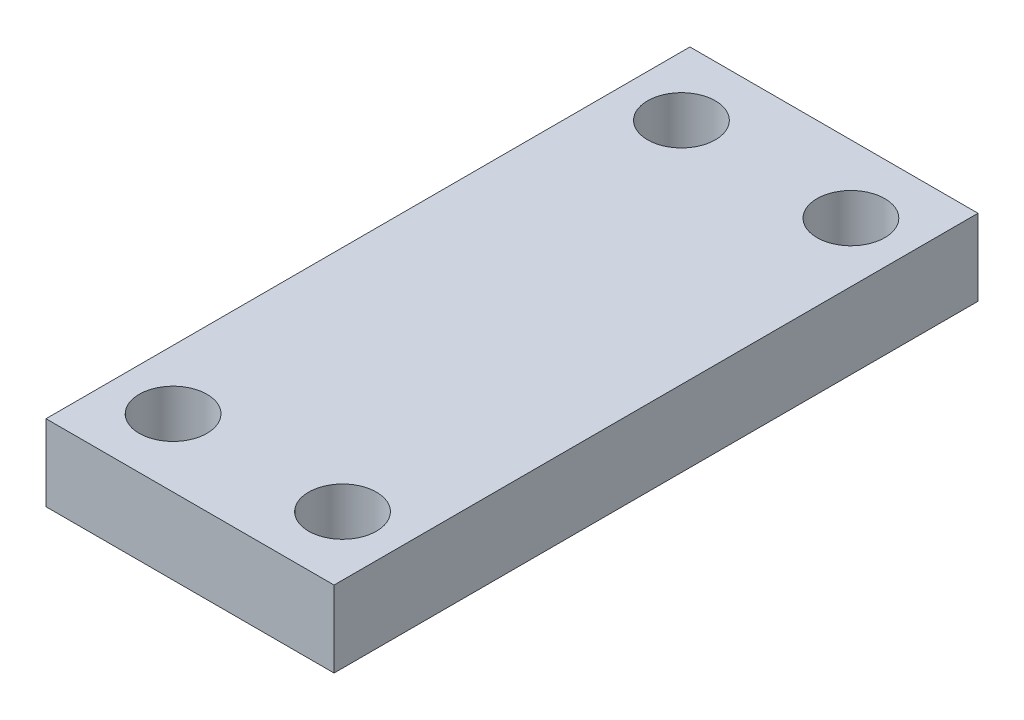
ISO-10303-21;
HEADER;
FILE_DESCRIPTION(('STEP AP214'),'2;1');
FILE_NAME('part.step','',(''),(''),'','','');
FILE_SCHEMA(('AUTOMOTIVE_DESIGN { 1 0 10303 214 1 1 1 1 }'));
ENDSEC;
DATA;
#1=APPLICATION_CONTEXT('core data for automotive mechanical design processes');
#2=APPLICATION_PROTOCOL_DEFINITION('international standard','automotive_design',2000,#1);
#3=PRODUCT_CONTEXT('',#1,'mechanical');
#4=PRODUCT('Part','Part','',(#3));
#5=PRODUCT_RELATED_PRODUCT_CATEGORY('part','',(#4));
#6=PRODUCT_DEFINITION_FORMATION('','',#4);
#7=PRODUCT_DEFINITION_CONTEXT('part definition',#1,'design');
#8=PRODUCT_DEFINITION('design','',#6,#7);
#9=PRODUCT_DEFINITION_SHAPE('','',#8);
#10=(LENGTH_UNIT() NAMED_UNIT(*) SI_UNIT(.MILLI.,.METRE.));
#11=(NAMED_UNIT(*) PLANE_ANGLE_UNIT() SI_UNIT($,.RADIAN.));
#12=(NAMED_UNIT(*) SI_UNIT($,.STERADIAN.) SOLID_ANGLE_UNIT());
#13=UNCERTAINTY_MEASURE_WITH_UNIT(LENGTH_MEASURE(1.E-05),#10,'distance_accuracy_value','');
#14=(GEOMETRIC_REPRESENTATION_CONTEXT(3) GLOBAL_UNCERTAINTY_ASSIGNED_CONTEXT((#13)) GLOBAL_UNIT_ASSIGNED_CONTEXT((#10,
#11,#12)) REPRESENTATION_CONTEXT('',''));
#15=CARTESIAN_POINT('',(0.,0.,0.));
#16=DIRECTION('',(0.,0.,1.));
#17=DIRECTION('',(1.,0.,0.));
#18=AXIS2_PLACEMENT_3D('',#15,#16,#17);
#19=CARTESIAN_POINT('',(-8.5,4.5,19.));
#20=DIRECTION('',(-1.,0.,0.));
#21=DIRECTION('',(0.,0.,1.));
#22=AXIS2_PLACEMENT_3D('',#19,#20,#21);
#23=PLANE('',#22);
#24=DIRECTION('',(0.,0.,-1.));
#25=VECTOR('',#24,1.);
#26=CARTESIAN_POINT('',(-8.5,0.,19.));
#27=LINE('',#26,#25);
#28=CARTESIAN_POINT('',(-8.5,0.,19.));
#29=VERTEX_POINT('',#28);
#30=CARTESIAN_POINT('',(-8.5,0.,-19.));
#31=VERTEX_POINT('',#30);
#32=EDGE_CURVE('E98',#29,#31,#27,.T.);
#33=ORIENTED_EDGE('',*,*,#32,.F.);
#34=DIRECTION('',(0.,-1.,0.));
#35=VECTOR('',#34,1.);
#36=CARTESIAN_POINT('',(-8.5,4.5,19.));
#37=LINE('',#36,#35);
#38=CARTESIAN_POINT('',(-8.5,4.5,19.));
#39=VERTEX_POINT('',#38);
#40=EDGE_CURVE('E11',#39,#29,#37,.T.);
#41=ORIENTED_EDGE('',*,*,#40,.F.);
#42=DIRECTION('',(0.,0.,-1.));
#43=VECTOR('',#42,1.);
#44=CARTESIAN_POINT('',(-8.5,4.5,19.));
#45=LINE('',#44,#43);
#46=CARTESIAN_POINT('',(-8.5,4.5,-19.));
#47=VERTEX_POINT('',#46);
#48=EDGE_CURVE('E92',#39,#47,#45,.T.);
#49=ORIENTED_EDGE('',*,*,#48,.T.);
#50=DIRECTION('',(0.,-1.,0.));
#51=VECTOR('',#50,1.);
#52=CARTESIAN_POINT('',(-8.5,4.5,-19.));
#53=LINE('',#52,#51);
#54=EDGE_CURVE('E35',#47,#31,#53,.T.);
#55=ORIENTED_EDGE('',*,*,#54,.T.);
#56=EDGE_LOOP('',(#33,#41,#49,#55));
#57=FACE_BOUND('',#56,.T.);
#58=ADVANCED_FACE('F32',(#57),#23,.T.);
#59=CARTESIAN_POINT('',(-8.5,4.5,19.));
#60=DIRECTION('',(0.,0.,-1.));
#61=DIRECTION('',(-1.,0.,0.));
#62=AXIS2_PLACEMENT_3D('',#59,#60,#61);
#63=PLANE('',#62);
#64=DIRECTION('',(1.,0.,0.));
#65=VECTOR('',#64,1.);
#66=CARTESIAN_POINT('',(-8.5,0.,19.));
#67=LINE('',#66,#65);
#68=CARTESIAN_POINT('',(8.5,0.,19.));
#69=VERTEX_POINT('',#68);
#70=EDGE_CURVE('E65',#29,#69,#67,.T.);
#71=ORIENTED_EDGE('',*,*,#70,.T.);
#72=DIRECTION('',(0.,-1.,0.));
#73=VECTOR('',#72,1.);
#74=CARTESIAN_POINT('',(8.5,4.5,19.));
#75=LINE('',#74,#73);
#76=CARTESIAN_POINT('',(8.5,4.5,19.));
#77=VERTEX_POINT('',#76);
#78=EDGE_CURVE('E41',#77,#69,#75,.T.);
#79=ORIENTED_EDGE('',*,*,#78,.F.);
#80=DIRECTION('',(1.,0.,0.));
#81=VECTOR('',#80,1.);
#82=CARTESIAN_POINT('',(-8.5,4.5,19.));
#83=LINE('',#82,#81);
#84=EDGE_CURVE('E82',#39,#77,#83,.T.);
#85=ORIENTED_EDGE('',*,*,#84,.F.);
#86=ORIENTED_EDGE('',*,*,#40,.T.);
#87=EDGE_LOOP('',(#71,#79,#85,#86));
#88=FACE_BOUND('',#87,.T.);
#89=ADVANCED_FACE('F109',(#88),#63,.F.);
#90=CARTESIAN_POINT('',(8.5,4.5,19.));
#91=DIRECTION('',(-1.,0.,0.));
#92=DIRECTION('',(0.,0.,1.));
#93=AXIS2_PLACEMENT_3D('',#90,#91,#92);
#94=PLANE('',#93);
#95=DIRECTION('',(0.,0.,-1.));
#96=VECTOR('',#95,1.);
#97=CARTESIAN_POINT('',(8.5,0.,19.));
#98=LINE('',#97,#96);
#99=CARTESIAN_POINT('',(8.5,0.,-19.));
#100=VERTEX_POINT('',#99);
#101=EDGE_CURVE('E89',#69,#100,#98,.T.);
#102=ORIENTED_EDGE('',*,*,#101,.T.);
#103=DIRECTION('',(0.,-1.,0.));
#104=VECTOR('',#103,1.);
#105=CARTESIAN_POINT('',(8.5,4.5,-19.));
#106=LINE('',#105,#104);
#107=CARTESIAN_POINT('',(8.5,4.5,-19.));
#108=VERTEX_POINT('',#107);
#109=EDGE_CURVE('E86',#108,#100,#106,.T.);
#110=ORIENTED_EDGE('',*,*,#109,.F.);
#111=DIRECTION('',(0.,0.,-1.));
#112=VECTOR('',#111,1.);
#113=CARTESIAN_POINT('',(8.5,4.5,19.));
#114=LINE('',#113,#112);
#115=EDGE_CURVE('E77',#77,#108,#114,.T.);
#116=ORIENTED_EDGE('',*,*,#115,.F.);
#117=ORIENTED_EDGE('',*,*,#78,.T.);
#118=EDGE_LOOP('',(#102,#110,#116,#117));
#119=FACE_BOUND('',#118,.T.);
#120=ADVANCED_FACE('F87',(#119),#94,.F.);
#121=CARTESIAN_POINT('',(-8.5,4.5,-19.));
#122=DIRECTION('',(0.,0.,-1.));
#123=DIRECTION('',(-1.,0.,0.));
#124=AXIS2_PLACEMENT_3D('',#121,#122,#123);
#125=PLANE('',#124);
#126=DIRECTION('',(1.,0.,0.));
#127=VECTOR('',#126,1.);
#128=CARTESIAN_POINT('',(-8.5,0.,-19.));
#129=LINE('',#128,#127);
#130=EDGE_CURVE('E101',#31,#100,#129,.T.);
#131=ORIENTED_EDGE('',*,*,#130,.F.);
#132=ORIENTED_EDGE('',*,*,#54,.F.);
#133=DIRECTION('',(1.,0.,0.));
#134=VECTOR('',#133,1.);
#135=CARTESIAN_POINT('',(-8.5,4.5,-19.));
#136=LINE('',#135,#134);
#137=EDGE_CURVE('E81',#47,#108,#136,.T.);
#138=ORIENTED_EDGE('',*,*,#137,.T.);
#139=ORIENTED_EDGE('',*,*,#109,.T.);
#140=EDGE_LOOP('',(#131,#132,#138,#139));
#141=FACE_BOUND('',#140,.T.);
#142=ADVANCED_FACE('F91',(#141),#125,.T.);
#143=CARTESIAN_POINT('',(0.,4.5,0.));
#144=DIRECTION('',(0.,-1.,0.));
#145=DIRECTION('',(0.,0.,-1.));
#146=AXIS2_PLACEMENT_3D('',#143,#144,#145);
#147=PLANE('',#146);
#148=CARTESIAN_POINT('',(-5.,4.5,15.));
#149=DIRECTION('',(0.,1.,0.));
#150=DIRECTION('',(0.,0.,1.));
#151=AXIS2_PLACEMENT_3D('',#148,#149,#150);
#152=CIRCLE('',#151,2.);
#153=CARTESIAN_POINT('',(-5.,4.5,17.));
#154=VERTEX_POINT('',#153);
#155=EDGE_CURVE('E151',#154,#154,#152,.T.);
#156=ORIENTED_EDGE('',*,*,#155,.F.);
#157=EDGE_LOOP('',(#156));
#158=FACE_BOUND('',#157,.T.);
#159=CARTESIAN_POINT('',(5.,4.5,15.));
#160=DIRECTION('',(0.,1.,0.));
#161=DIRECTION('',(0.,0.,1.));
#162=AXIS2_PLACEMENT_3D('',#159,#160,#161);
#163=CIRCLE('',#162,2.);
#164=CARTESIAN_POINT('',(5.,4.5,17.));
#165=VERTEX_POINT('',#164);
#166=EDGE_CURVE('E155',#165,#165,#163,.T.);
#167=ORIENTED_EDGE('',*,*,#166,.F.);
#168=EDGE_LOOP('',(#167));
#169=FACE_BOUND('',#168,.T.);
#170=CARTESIAN_POINT('',(5.,4.5,-15.));
#171=DIRECTION('',(0.,1.,0.));
#172=DIRECTION('',(0.,0.,1.));
#173=AXIS2_PLACEMENT_3D('',#170,#171,#172);
#174=CIRCLE('',#173,2.);
#175=CARTESIAN_POINT('',(5.,4.5,-13.));
#176=VERTEX_POINT('',#175);
#177=EDGE_CURVE('E163',#176,#176,#174,.T.);
#178=ORIENTED_EDGE('',*,*,#177,.F.);
#179=EDGE_LOOP('',(#178));
#180=FACE_BOUND('',#179,.T.);
#181=CARTESIAN_POINT('',(-5.,4.5,-15.));
#182=DIRECTION('',(0.,1.,0.));
#183=DIRECTION('',(0.,0.,1.));
#184=AXIS2_PLACEMENT_3D('',#181,#182,#183);
#185=CIRCLE('',#184,2.);
#186=CARTESIAN_POINT('',(-5.,4.5,-13.));
#187=VERTEX_POINT('',#186);
#188=EDGE_CURVE('E102',#187,#187,#185,.T.);
#189=ORIENTED_EDGE('',*,*,#188,.F.);
#190=EDGE_LOOP('',(#189));
#191=FACE_BOUND('',#190,.T.);
#192=ORIENTED_EDGE('',*,*,#48,.F.);
#193=ORIENTED_EDGE('',*,*,#84,.T.);
#194=ORIENTED_EDGE('',*,*,#115,.T.);
#195=ORIENTED_EDGE('',*,*,#137,.F.);
#196=EDGE_LOOP('',(#192,#193,#194,#195));
#197=FACE_BOUND('',#196,.T.);
#198=ADVANCED_FACE('F80',(#158,#169,#180,#191,#197),#147,.F.);
#199=CARTESIAN_POINT('',(0.,0.,0.));
#200=DIRECTION('',(0.,-1.,0.));
#201=DIRECTION('',(0.,0.,-1.));
#202=AXIS2_PLACEMENT_3D('',#199,#200,#201);
#203=PLANE('',#202);
#204=CARTESIAN_POINT('',(-5.,0.,15.));
#205=DIRECTION('',(0.,1.,0.));
#206=DIRECTION('',(0.,0.,1.));
#207=AXIS2_PLACEMENT_3D('',#204,#205,#206);
#208=CIRCLE('',#207,2.);
#209=CARTESIAN_POINT('',(-5.,0.,17.));
#210=VERTEX_POINT('',#209);
#211=EDGE_CURVE('E154',#210,#210,#208,.T.);
#212=ORIENTED_EDGE('',*,*,#211,.T.);
#213=EDGE_LOOP('',(#212));
#214=FACE_BOUND('',#213,.T.);
#215=CARTESIAN_POINT('',(5.,0.,15.));
#216=DIRECTION('',(0.,1.,0.));
#217=DIRECTION('',(0.,0.,1.));
#218=AXIS2_PLACEMENT_3D('',#215,#216,#217);
#219=CIRCLE('',#218,2.);
#220=CARTESIAN_POINT('',(5.,0.,17.));
#221=VERTEX_POINT('',#220);
#222=EDGE_CURVE('E158',#221,#221,#219,.T.);
#223=ORIENTED_EDGE('',*,*,#222,.T.);
#224=EDGE_LOOP('',(#223));
#225=FACE_BOUND('',#224,.T.);
#226=CARTESIAN_POINT('',(5.,0.,-15.));
#227=DIRECTION('',(0.,1.,0.));
#228=DIRECTION('',(0.,0.,1.));
#229=AXIS2_PLACEMENT_3D('',#226,#227,#228);
#230=CIRCLE('',#229,2.);
#231=CARTESIAN_POINT('',(5.,0.,-13.));
#232=VERTEX_POINT('',#231);
#233=EDGE_CURVE('E165',#232,#232,#230,.T.);
#234=ORIENTED_EDGE('',*,*,#233,.T.);
#235=EDGE_LOOP('',(#234));
#236=FACE_BOUND('',#235,.T.);
#237=CARTESIAN_POINT('',(-5.,0.,-15.));
#238=DIRECTION('',(0.,1.,0.));
#239=DIRECTION('',(0.,0.,1.));
#240=AXIS2_PLACEMENT_3D('',#237,#238,#239);
#241=CIRCLE('',#240,2.);
#242=CARTESIAN_POINT('',(-5.,0.,-13.));
#243=VERTEX_POINT('',#242);
#244=EDGE_CURVE('E168',#243,#243,#241,.T.);
#245=ORIENTED_EDGE('',*,*,#244,.T.);
#246=EDGE_LOOP('',(#245));
#247=FACE_BOUND('',#246,.T.);
#248=ORIENTED_EDGE('',*,*,#32,.T.);
#249=ORIENTED_EDGE('',*,*,#130,.T.);
#250=ORIENTED_EDGE('',*,*,#101,.F.);
#251=ORIENTED_EDGE('',*,*,#70,.F.);
#252=EDGE_LOOP('',(#248,#249,#250,#251));
#253=FACE_BOUND('',#252,.T.);
#254=ADVANCED_FACE('F107',(#214,#225,#236,#247,#253),#203,.T.);
#255=CARTESIAN_POINT('',(-5.,4.5,-15.));
#256=DIRECTION('',(0.,-1.,0.));
#257=DIRECTION('',(0.,0.,-1.));
#258=AXIS2_PLACEMENT_3D('',#255,#256,#257);
#259=CYLINDRICAL_SURFACE('',#258,2.);
#260=ORIENTED_EDGE('',*,*,#188,.T.);
#261=EDGE_LOOP('',(#260));
#262=FACE_BOUND('',#261,.T.);
#263=ORIENTED_EDGE('',*,*,#244,.F.);
#264=EDGE_LOOP('',(#263));
#265=FACE_BOUND('',#264,.T.);
#266=ADVANCED_FACE('F128',(#262,#265),#259,.F.);
#267=CARTESIAN_POINT('',(5.,4.5,-15.));
#268=DIRECTION('',(0.,-1.,0.));
#269=DIRECTION('',(0.,0.,-1.));
#270=AXIS2_PLACEMENT_3D('',#267,#268,#269);
#271=CYLINDRICAL_SURFACE('',#270,2.);
#272=ORIENTED_EDGE('',*,*,#177,.T.);
#273=EDGE_LOOP('',(#272));
#274=FACE_BOUND('',#273,.T.);
#275=ORIENTED_EDGE('',*,*,#233,.F.);
#276=EDGE_LOOP('',(#275));
#277=FACE_BOUND('',#276,.T.);
#278=ADVANCED_FACE('F135',(#274,#277),#271,.F.);
#279=CARTESIAN_POINT('',(5.,4.5,15.));
#280=DIRECTION('',(0.,-1.,0.));
#281=DIRECTION('',(0.,0.,-1.));
#282=AXIS2_PLACEMENT_3D('',#279,#280,#281);
#283=CYLINDRICAL_SURFACE('',#282,2.);
#284=ORIENTED_EDGE('',*,*,#166,.T.);
#285=EDGE_LOOP('',(#284));
#286=FACE_BOUND('',#285,.T.);
#287=ORIENTED_EDGE('',*,*,#222,.F.);
#288=EDGE_LOOP('',(#287));
#289=FACE_BOUND('',#288,.T.);
#290=ADVANCED_FACE('F139',(#286,#289),#283,.F.);
#291=CARTESIAN_POINT('',(-5.,4.5,15.));
#292=DIRECTION('',(0.,-1.,0.));
#293=DIRECTION('',(0.,0.,-1.));
#294=AXIS2_PLACEMENT_3D('',#291,#292,#293);
#295=CYLINDRICAL_SURFACE('',#294,2.);
#296=ORIENTED_EDGE('',*,*,#155,.T.);
#297=EDGE_LOOP('',(#296));
#298=FACE_BOUND('',#297,.T.);
#299=ORIENTED_EDGE('',*,*,#211,.F.);
#300=EDGE_LOOP('',(#299));
#301=FACE_BOUND('',#300,.T.);
#302=ADVANCED_FACE('F143',(#298,#301),#295,.F.);
#303=CLOSED_SHELL('',(#58,#89,#120,#142,#198,#254,#266,#278,#290,#302));
#304=MANIFOLD_SOLID_BREP('B2',#303);
#305=ADVANCED_BREP_SHAPE_REPRESENTATION('',(#18,#304),#14);
#306=SHAPE_DEFINITION_REPRESENTATION(#9,#305);
ENDSEC;
END-ISO-10303-21;
